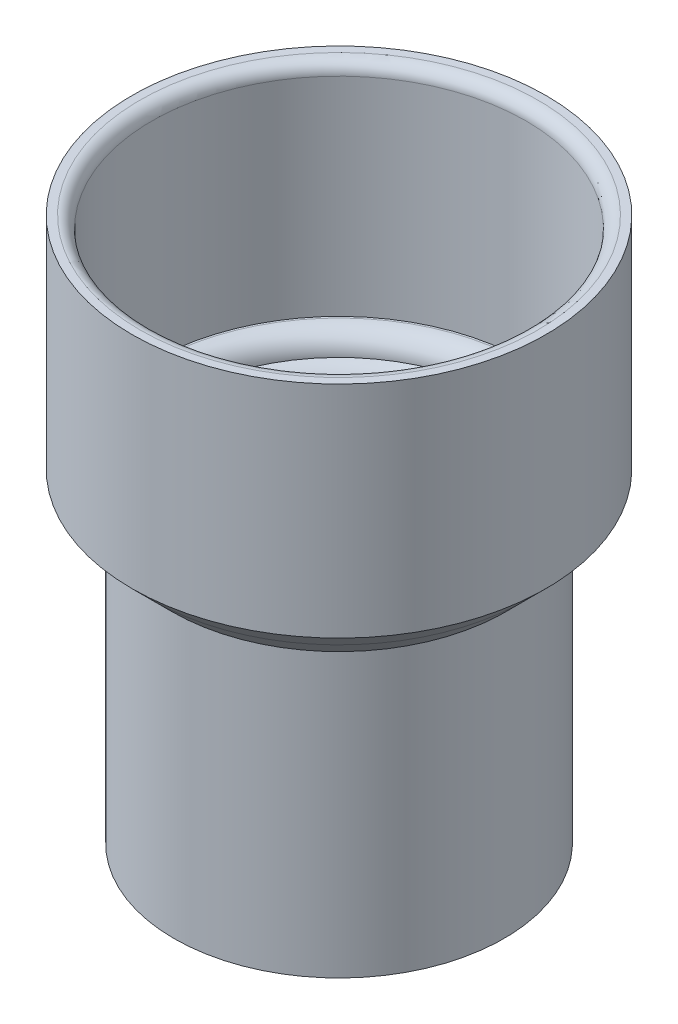
ISO-10303-21;
HEADER;
FILE_DESCRIPTION(('STEP AP214'),'2;1');
FILE_NAME('part.step','',(''),(''),'','','');
FILE_SCHEMA(('AUTOMOTIVE_DESIGN { 1 0 10303 214 1 1 1 1 }'));
ENDSEC;
DATA;
#1=APPLICATION_CONTEXT('core data for automotive mechanical design processes');
#2=APPLICATION_PROTOCOL_DEFINITION('international standard','automotive_design',2000,#1);
#3=PRODUCT_CONTEXT('',#1,'mechanical');
#4=PRODUCT('Part','Part','',(#3));
#5=PRODUCT_RELATED_PRODUCT_CATEGORY('part','',(#4));
#6=PRODUCT_DEFINITION_FORMATION('','',#4);
#7=PRODUCT_DEFINITION_CONTEXT('part definition',#1,'design');
#8=PRODUCT_DEFINITION('design','',#6,#7);
#9=PRODUCT_DEFINITION_SHAPE('','',#8);
#10=(LENGTH_UNIT() NAMED_UNIT(*) SI_UNIT(.MILLI.,.METRE.));
#11=(NAMED_UNIT(*) PLANE_ANGLE_UNIT() SI_UNIT($,.RADIAN.));
#12=(NAMED_UNIT(*) SI_UNIT($,.STERADIAN.) SOLID_ANGLE_UNIT());
#13=UNCERTAINTY_MEASURE_WITH_UNIT(LENGTH_MEASURE(1.E-05),#10,'distance_accuracy_value','');
#14=(GEOMETRIC_REPRESENTATION_CONTEXT(3) GLOBAL_UNCERTAINTY_ASSIGNED_CONTEXT((#13)) GLOBAL_UNIT_ASSIGNED_CONTEXT((#10,
#11,#12)) REPRESENTATION_CONTEXT('',''));
#15=CARTESIAN_POINT('',(0.,0.,0.));
#16=DIRECTION('',(0.,0.,1.));
#17=DIRECTION('',(1.,0.,0.));
#18=AXIS2_PLACEMENT_3D('',#15,#16,#17);
#19=CARTESIAN_POINT('',(0.,76.,0.));
#20=DIRECTION('',(0.,-1.,0.));
#21=DIRECTION('',(0.,0.,-1.));
#22=AXIS2_PLACEMENT_3D('',#19,#20,#21);
#23=CYLINDRICAL_SURFACE('',#22,41.25);
#24=CARTESIAN_POINT('',(0.,0.,0.));
#25=DIRECTION('',(0.,1.,0.));
#26=DIRECTION('',(0.,0.,1.));
#27=AXIS2_PLACEMENT_3D('',#24,#25,#26);
#28=CIRCLE('',#27,41.25);
#29=CARTESIAN_POINT('',(0.,0.,41.25));
#30=VERTEX_POINT('',#29);
#31=EDGE_CURVE('E68',#30,#30,#28,.T.);
#32=ORIENTED_EDGE('',*,*,#31,.T.);
#33=EDGE_LOOP('',(#32));
#34=FACE_BOUND('',#33,.T.);
#35=CARTESIAN_POINT('',(0.,71.,0.));
#36=DIRECTION('',(0.,1.,0.));
#37=DIRECTION('',(0.,0.,1.));
#38=AXIS2_PLACEMENT_3D('',#35,#36,#37);
#39=CIRCLE('',#38,41.25);
#40=CARTESIAN_POINT('',(0.,71.,41.25));
#41=VERTEX_POINT('',#40);
#42=EDGE_CURVE('E65',#41,#41,#39,.T.);
#43=ORIENTED_EDGE('',*,*,#42,.F.);
#44=EDGE_LOOP('',(#43));
#45=FACE_BOUND('',#44,.T.);
#46=ADVANCED_FACE('F39',(#34,#45),#23,.T.);
#47=CARTESIAN_POINT('',(0.,0.,0.));
#48=DIRECTION('',(0.,1.,0.));
#49=DIRECTION('',(0.,0.,1.));
#50=AXIS2_PLACEMENT_3D('',#47,#48,#49);
#51=PLANE('',#50);
#52=ORIENTED_EDGE('',*,*,#31,.F.);
#53=EDGE_LOOP('',(#52));
#54=FACE_BOUND('',#53,.T.);
#55=CARTESIAN_POINT('',(0.,0.,0.));
#56=DIRECTION('',(0.,1.,0.));
#57=DIRECTION('',(0.,0.,1.));
#58=AXIS2_PLACEMENT_3D('',#55,#56,#57);
#59=CIRCLE('',#58,37.5);
#60=CARTESIAN_POINT('',(0.,0.,37.5));
#61=VERTEX_POINT('',#60);
#62=EDGE_CURVE('E71',#61,#61,#59,.T.);
#63=ORIENTED_EDGE('',*,*,#62,.T.);
#64=EDGE_LOOP('',(#63));
#65=FACE_BOUND('',#64,.T.);
#66=ADVANCED_FACE('F108',(#54,#65),#51,.F.);
#67=CARTESIAN_POINT('',(0.,76.,0.));
#68=DIRECTION('',(0.,-1.,0.));
#69=DIRECTION('',(0.,0.,-1.));
#70=AXIS2_PLACEMENT_3D('',#67,#68,#69);
#71=CYLINDRICAL_SURFACE('',#70,37.5);
#72=CARTESIAN_POINT('',(0.,71.1587708172407,0.));
#73=DIRECTION('',(0.,1.,0.));
#74=DIRECTION('',(0.,0.,1.));
#75=AXIS2_PLACEMENT_3D('',#72,#73,#74);
#76=CIRCLE('',#75,37.5);
#77=CARTESIAN_POINT('',(0.,71.1587708172407,37.5));
#78=VERTEX_POINT('',#77);
#79=EDGE_CURVE('E50',#78,#78,#76,.T.);
#80=ORIENTED_EDGE('',*,*,#79,.T.);
#81=EDGE_LOOP('',(#80));
#82=FACE_BOUND('',#81,.T.);
#83=ORIENTED_EDGE('',*,*,#62,.F.);
#84=EDGE_LOOP('',(#83));
#85=FACE_BOUND('',#84,.T.);
#86=ADVANCED_FACE('F113',(#82,#85),#71,.F.);
#87=CARTESIAN_POINT('',(0.,71.,0.));
#88=DIRECTION('',(0.,1.,0.));
#89=DIRECTION('',(0.,0.,1.));
#90=AXIS2_PLACEMENT_3D('',#87,#88,#89);
#91=PLANE('',#90);
#92=CARTESIAN_POINT('',(0.,71.,0.));
#93=DIRECTION('',(0.,1.,0.));
#94=DIRECTION('',(0.,0.,1.));
#95=AXIS2_PLACEMENT_3D('',#92,#93,#94);
#96=CIRCLE('',#95,41.75);
#97=CARTESIAN_POINT('',(0.,71.,41.75));
#98=VERTEX_POINT('',#97);
#99=EDGE_CURVE('E62',#98,#98,#96,.F.);
#100=ORIENTED_EDGE('',*,*,#99,.T.);
#101=EDGE_LOOP('',(#100));
#102=FACE_BOUND('',#101,.T.);
#103=ORIENTED_EDGE('',*,*,#42,.T.);
#104=EDGE_LOOP('',(#103));
#105=FACE_BOUND('',#104,.T.);
#106=ADVANCED_FACE('F120',(#102,#105),#91,.F.);
#107=CARTESIAN_POINT('',(0.,81.,0.));
#108=DIRECTION('',(0.,1.,0.));
#109=DIRECTION('',(0.,0.,1.));
#110=AXIS2_PLACEMENT_3D('',#107,#108,#109);
#111=PLANE('',#110);
#112=CARTESIAN_POINT('',(0.,81.,0.));
#113=DIRECTION('',(0.,1.,0.));
#114=DIRECTION('',(0.,0.,1.));
#115=AXIS2_PLACEMENT_3D('',#112,#113,#114);
#116=CIRCLE('',#115,46.25);
#117=CARTESIAN_POINT('',(0.,81.,46.25));
#118=VERTEX_POINT('',#117);
#119=EDGE_CURVE('E54',#118,#118,#116,.F.);
#120=ORIENTED_EDGE('',*,*,#119,.T.);
#121=EDGE_LOOP('',(#120));
#122=FACE_BOUND('',#121,.T.);
#123=CARTESIAN_POINT('',(0.,81.,0.));
#124=DIRECTION('',(0.,1.,0.));
#125=DIRECTION('',(0.,0.,1.));
#126=AXIS2_PLACEMENT_3D('',#123,#124,#125);
#127=CIRCLE('',#126,46.75);
#128=CARTESIAN_POINT('',(0.,81.,46.75));
#129=VERTEX_POINT('',#128);
#130=EDGE_CURVE('E77',#129,#129,#127,.F.);
#131=ORIENTED_EDGE('',*,*,#130,.F.);
#132=EDGE_LOOP('',(#131));
#133=FACE_BOUND('',#132,.T.);
#134=ADVANCED_FACE('F124',(#122,#133),#111,.T.);
#135=CARTESIAN_POINT('',(0.,136.,0.));
#136=DIRECTION('',(0.,1.,0.));
#137=DIRECTION('',(0.,0.,1.));
#138=AXIS2_PLACEMENT_3D('',#135,#136,#137);
#139=PLANE('',#138);
#140=CARTESIAN_POINT('',(0.,136.,0.));
#141=DIRECTION('',(0.,1.,0.));
#142=DIRECTION('',(0.,0.,1.));
#143=AXIS2_PLACEMENT_3D('',#140,#141,#142);
#144=CIRCLE('',#143,49.75);
#145=CARTESIAN_POINT('',(0.,136.,49.75));
#146=VERTEX_POINT('',#145);
#147=EDGE_CURVE('E10',#146,#146,#144,.F.);
#148=ORIENTED_EDGE('',*,*,#147,.T.);
#149=EDGE_LOOP('',(#148));
#150=FACE_BOUND('',#149,.T.);
#151=CARTESIAN_POINT('',(0.,136.,0.));
#152=DIRECTION('',(0.,1.,0.));
#153=DIRECTION('',(0.,0.,1.));
#154=AXIS2_PLACEMENT_3D('',#151,#152,#153);
#155=CIRCLE('',#154,51.75);
#156=CARTESIAN_POINT('',(0.,136.,51.75));
#157=VERTEX_POINT('',#156);
#158=EDGE_CURVE('E80',#157,#157,#155,.T.);
#159=ORIENTED_EDGE('',*,*,#158,.T.);
#160=EDGE_LOOP('',(#159));
#161=FACE_BOUND('',#160,.T.);
#162=ADVANCED_FACE('F128',(#150,#161),#139,.T.);
#163=CARTESIAN_POINT('',(0.,136.,0.));
#164=DIRECTION('',(0.,-1.,0.));
#165=DIRECTION('',(0.,0.,-1.));
#166=AXIS2_PLACEMENT_3D('',#163,#164,#165);
#167=CYLINDRICAL_SURFACE('',#166,51.75);
#168=CARTESIAN_POINT('',(0.,81.,0.));
#169=DIRECTION('',(0.,1.,0.));
#170=DIRECTION('',(0.,0.,1.));
#171=AXIS2_PLACEMENT_3D('',#168,#169,#170);
#172=CIRCLE('',#171,51.75);
#173=CARTESIAN_POINT('',(0.,81.,51.75));
#174=VERTEX_POINT('',#173);
#175=EDGE_CURVE('E59',#174,#174,#172,.T.);
#176=ORIENTED_EDGE('',*,*,#175,.T.);
#177=EDGE_LOOP('',(#176));
#178=FACE_BOUND('',#177,.T.);
#179=ORIENTED_EDGE('',*,*,#158,.F.);
#180=EDGE_LOOP('',(#179));
#181=FACE_BOUND('',#180,.T.);
#182=ADVANCED_FACE('F102',(#178,#181),#167,.T.);
#183=CARTESIAN_POINT('',(0.,136.,0.));
#184=DIRECTION('',(0.,-1.,0.));
#185=DIRECTION('',(0.,0.,-1.));
#186=AXIS2_PLACEMENT_3D('',#183,#184,#185);
#187=CYLINDRICAL_SURFACE('',#186,46.75);
#188=CARTESIAN_POINT('',(0.,133.,0.));
#189=DIRECTION('',(0.,1.,0.));
#190=DIRECTION('',(0.,0.,1.));
#191=AXIS2_PLACEMENT_3D('',#188,#189,#190);
#192=CIRCLE('',#191,46.75);
#193=CARTESIAN_POINT('',(0.,133.,46.75));
#194=VERTEX_POINT('',#193);
#195=EDGE_CURVE('E46',#194,#194,#192,.T.);
#196=ORIENTED_EDGE('',*,*,#195,.T.);
#197=EDGE_LOOP('',(#196));
#198=FACE_BOUND('',#197,.T.);
#199=ORIENTED_EDGE('',*,*,#130,.T.);
#200=EDGE_LOOP('',(#199));
#201=FACE_BOUND('',#200,.T.);
#202=ADVANCED_FACE('F92',(#198,#201),#187,.F.);
#203=CARTESIAN_POINT('',(0.,76.,0.));
#204=DIRECTION('',(0.,1.,0.));
#205=DIRECTION('',(0.,0.,1.));
#206=AXIS2_PLACEMENT_3D('',#203,#204,#205);
#207=CONICAL_SURFACE('',#206,46.75,0.78539816339745);
#208=ORIENTED_EDGE('',*,*,#99,.F.);
#209=EDGE_LOOP('',(#208));
#210=FACE_BOUND('',#209,.T.);
#211=CARTESIAN_POINT('',(0.,76.,0.));
#212=DIRECTION('',(0.,1.,0.));
#213=DIRECTION('',(0.,0.,1.));
#214=AXIS2_PLACEMENT_3D('',#211,#212,#213);
#215=CIRCLE('',#214,46.75);
#216=CARTESIAN_POINT('',(0.,76.,46.75));
#217=VERTEX_POINT('',#216);
#218=EDGE_CURVE('E83',#217,#217,#215,.T.);
#219=ORIENTED_EDGE('',*,*,#218,.F.);
#220=EDGE_LOOP('',(#219));
#221=FACE_BOUND('',#220,.T.);
#222=ADVANCED_FACE('F90',(#210,#221),#207,.T.);
#223=CARTESIAN_POINT('',(0.,81.,0.));
#224=DIRECTION('',(0.,1.,0.));
#225=DIRECTION('',(0.,0.,1.));
#226=AXIS2_PLACEMENT_3D('',#223,#224,#225);
#227=CONICAL_SURFACE('',#226,51.75,0.78539816339745);
#228=ORIENTED_EDGE('',*,*,#218,.T.);
#229=EDGE_LOOP('',(#228));
#230=FACE_BOUND('',#229,.T.);
#231=ORIENTED_EDGE('',*,*,#175,.F.);
#232=EDGE_LOOP('',(#231));
#233=FACE_BOUND('',#232,.T.);
#234=ADVANCED_FACE('F87',(#230,#233),#227,.T.);
#235=CARTESIAN_POINT('',(0.,76.,0.));
#236=DIRECTION('',(0.,1.,0.));
#237=DIRECTION('',(0.,0.,1.));
#238=AXIS2_PLACEMENT_3D('',#235,#236,#237);
#239=TOROIDAL_SURFACE('',#238,46.25,5.);
#240=ORIENTED_EDGE('',*,*,#119,.F.);
#241=EDGE_LOOP('',(#240));
#242=FACE_BOUND('',#241,.T.);
#243=CARTESIAN_POINT('',(0.,76.,0.));
#244=DIRECTION('',(0.,1.,0.));
#245=DIRECTION('',(0.,0.,1.));
#246=AXIS2_PLACEMENT_3D('',#243,#244,#245);
#247=CIRCLE('',#246,41.25);
#248=CARTESIAN_POINT('',(0.,76.,41.25));
#249=VERTEX_POINT('',#248);
#250=EDGE_CURVE('E74',#249,#249,#247,.T.);
#251=ORIENTED_EDGE('',*,*,#250,.F.);
#252=EDGE_LOOP('',(#251));
#253=FACE_BOUND('',#252,.T.);
#254=ADVANCED_FACE('F99',(#242,#253),#239,.T.);
#255=CARTESIAN_POINT('',(0.,71.1587708172407,0.));
#256=DIRECTION('',(0.,1.,0.));
#257=DIRECTION('',(0.,0.,1.));
#258=AXIS2_PLACEMENT_3D('',#255,#256,#257);
#259=TOROIDAL_SURFACE('',#258,42.5,5.);
#260=ORIENTED_EDGE('',*,*,#250,.T.);
#261=EDGE_LOOP('',(#260));
#262=FACE_BOUND('',#261,.T.);
#263=ORIENTED_EDGE('',*,*,#79,.F.);
#264=EDGE_LOOP('',(#263));
#265=FACE_BOUND('',#264,.T.);
#266=ADVANCED_FACE('F144',(#262,#265),#259,.T.);
#267=CARTESIAN_POINT('',(0.,133.,0.));
#268=DIRECTION('',(0.,1.,0.));
#269=DIRECTION('',(0.,0.,1.));
#270=AXIS2_PLACEMENT_3D('',#267,#268,#269);
#271=TOROIDAL_SURFACE('',#270,49.75,3.);
#272=ORIENTED_EDGE('',*,*,#147,.F.);
#273=EDGE_LOOP('',(#272));
#274=FACE_BOUND('',#273,.T.);
#275=ORIENTED_EDGE('',*,*,#195,.F.);
#276=EDGE_LOOP('',(#275));
#277=FACE_BOUND('',#276,.T.);
#278=ADVANCED_FACE('F41',(#274,#277),#271,.T.);
#279=CLOSED_SHELL('',(#46,#66,#86,#106,#134,#162,#182,#202,#222,#234,#254,#266,#278));
#280=MANIFOLD_SOLID_BREP('B2',#279);
#281=ADVANCED_BREP_SHAPE_REPRESENTATION('',(#18,#280),#14);
#282=SHAPE_DEFINITION_REPRESENTATION(#9,#281);
ENDSEC;
END-ISO-10303-21;
